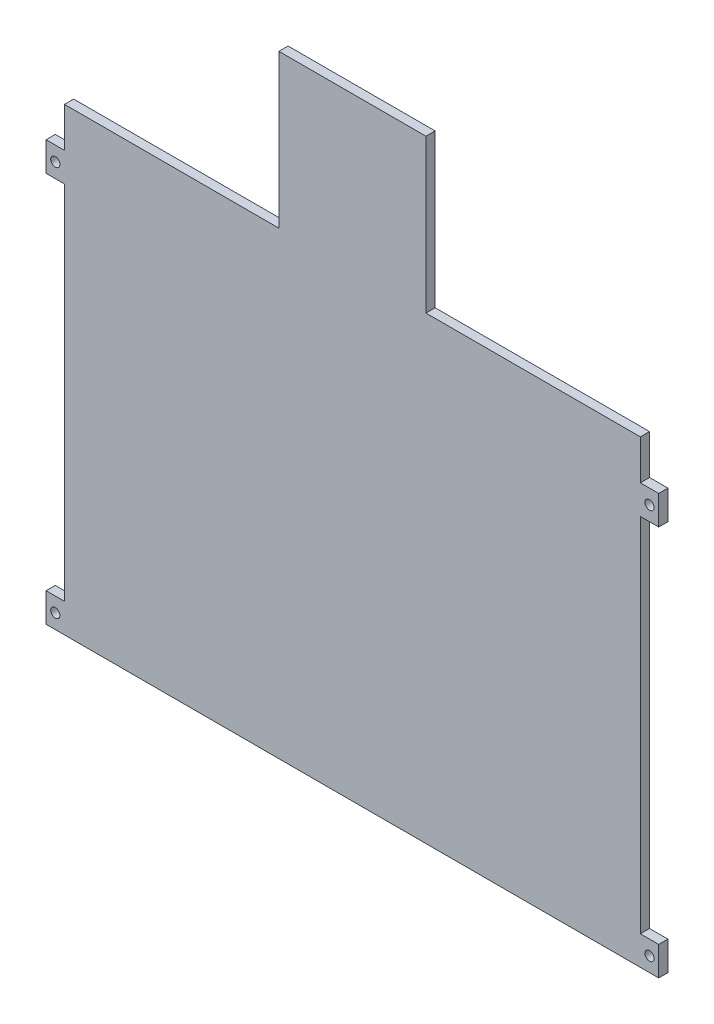
ISO-10303-21;
HEADER;
FILE_DESCRIPTION(('STEP AP214'),'2;1');
FILE_NAME('part.step','',(''),(''),'','','');
FILE_SCHEMA(('AUTOMOTIVE_DESIGN { 1 0 10303 214 1 1 1 1 }'));
ENDSEC;
DATA;
#1=APPLICATION_CONTEXT('core data for automotive mechanical design processes');
#2=APPLICATION_PROTOCOL_DEFINITION('international standard','automotive_design',2000,#1);
#3=PRODUCT_CONTEXT('',#1,'mechanical');
#4=PRODUCT('Part','Part','',(#3));
#5=PRODUCT_RELATED_PRODUCT_CATEGORY('part','',(#4));
#6=PRODUCT_DEFINITION_FORMATION('','',#4);
#7=PRODUCT_DEFINITION_CONTEXT('part definition',#1,'design');
#8=PRODUCT_DEFINITION('design','',#6,#7);
#9=PRODUCT_DEFINITION_SHAPE('','',#8);
#10=(LENGTH_UNIT() NAMED_UNIT(*) SI_UNIT(.MILLI.,.METRE.));
#11=(NAMED_UNIT(*) PLANE_ANGLE_UNIT() SI_UNIT($,.RADIAN.));
#12=(NAMED_UNIT(*) SI_UNIT($,.STERADIAN.) SOLID_ANGLE_UNIT());
#13=UNCERTAINTY_MEASURE_WITH_UNIT(LENGTH_MEASURE(1.E-05),#10,'distance_accuracy_value','');
#14=(GEOMETRIC_REPRESENTATION_CONTEXT(3) GLOBAL_UNCERTAINTY_ASSIGNED_CONTEXT((#13)) GLOBAL_UNIT_ASSIGNED_CONTEXT((#10,
#11,#12)) REPRESENTATION_CONTEXT('',''));
#15=CARTESIAN_POINT('',(0.,0.,0.));
#16=DIRECTION('',(0.,0.,1.));
#17=DIRECTION('',(1.,0.,0.));
#18=AXIS2_PLACEMENT_3D('',#15,#16,#17);
#19=CARTESIAN_POINT('',(0.,0.,3.));
#20=DIRECTION('',(0.,0.,1.));
#21=DIRECTION('',(1.,0.,0.));
#22=AXIS2_PLACEMENT_3D('',#19,#20,#21);
#23=PLANE('',#22);
#24=CARTESIAN_POINT('',(-97.,32.2499999999999,3.));
#25=DIRECTION('',(0.,0.,1.));
#26=DIRECTION('',(-1.,0.,0.));
#27=AXIS2_PLACEMENT_3D('',#24,#25,#26);
#28=CIRCLE('',#27,1.5);
#29=CARTESIAN_POINT('',(-98.5,32.2499999999999,3.));
#30=VERTEX_POINT('',#29);
#31=EDGE_CURVE('E607',#30,#30,#28,.T.);
#32=ORIENTED_EDGE('',*,*,#31,.F.);
#33=EDGE_LOOP('',(#32));
#34=FACE_BOUND('',#33,.T.);
#35=CARTESIAN_POINT('',(97.0000000000001,-95.25,3.));
#36=DIRECTION('',(0.,0.,1.));
#37=DIRECTION('',(1.,0.,0.));
#38=AXIS2_PLACEMENT_3D('',#35,#36,#37);
#39=CIRCLE('',#38,1.49999999999997);
#40=CARTESIAN_POINT('',(98.5,-95.25,3.));
#41=VERTEX_POINT('',#40);
#42=EDGE_CURVE('E211',#41,#41,#39,.T.);
#43=ORIENTED_EDGE('',*,*,#42,.F.);
#44=EDGE_LOOP('',(#43));
#45=FACE_BOUND('',#44,.T.);
#46=DIRECTION('',(1.,0.,0.));
#47=VECTOR('',#46,1.);
#48=CARTESIAN_POINT('',(94.,-100.,3.));
#49=LINE('',#48,#47);
#50=CARTESIAN_POINT('',(-100.,-100.,3.));
#51=VERTEX_POINT('',#50);
#52=CARTESIAN_POINT('',(100.,-100.,3.));
#53=VERTEX_POINT('',#52);
#54=EDGE_CURVE('E51',#51,#53,#49,.T.);
#55=ORIENTED_EDGE('',*,*,#54,.T.);
#56=DIRECTION('',(0.,1.,0.));
#57=VECTOR('',#56,1.);
#58=CARTESIAN_POINT('',(100.,-100.,3.));
#59=LINE('',#58,#57);
#60=CARTESIAN_POINT('',(100.,-90.5,3.));
#61=VERTEX_POINT('',#60);
#62=EDGE_CURVE('E132',#53,#61,#59,.T.);
#63=ORIENTED_EDGE('',*,*,#62,.T.);
#64=DIRECTION('',(-1.,0.,0.));
#65=VECTOR('',#64,1.);
#66=CARTESIAN_POINT('',(100.,-90.5,3.));
#67=LINE('',#66,#65);
#68=CARTESIAN_POINT('',(94.0000000000001,-90.5,3.));
#69=VERTEX_POINT('',#68);
#70=EDGE_CURVE('E296',#61,#69,#67,.T.);
#71=ORIENTED_EDGE('',*,*,#70,.T.);
#72=DIRECTION('',(0.,1.,0.));
#73=VECTOR('',#72,1.);
#74=CARTESIAN_POINT('',(94.,27.5,3.));
#75=LINE('',#74,#73);
#76=CARTESIAN_POINT('',(94.,27.5,3.));
#77=VERTEX_POINT('',#76);
#78=EDGE_CURVE('E313',#69,#77,#75,.T.);
#79=ORIENTED_EDGE('',*,*,#78,.T.);
#80=DIRECTION('',(1.,0.,0.));
#81=VECTOR('',#80,1.);
#82=CARTESIAN_POINT('',(94.,27.5,3.));
#83=LINE('',#82,#81);
#84=CARTESIAN_POINT('',(100.,27.5,3.));
#85=VERTEX_POINT('',#84);
#86=EDGE_CURVE('E310',#77,#85,#83,.T.);
#87=ORIENTED_EDGE('',*,*,#86,.T.);
#88=DIRECTION('',(0.,1.,0.));
#89=VECTOR('',#88,1.);
#90=CARTESIAN_POINT('',(100.,27.5,3.));
#91=LINE('',#90,#89);
#92=CARTESIAN_POINT('',(100.,37.,3.));
#93=VERTEX_POINT('',#92);
#94=EDGE_CURVE('E312',#85,#93,#91,.T.);
#95=ORIENTED_EDGE('',*,*,#94,.T.);
#96=DIRECTION('',(-1.,0.,0.));
#97=VECTOR('',#96,1.);
#98=CARTESIAN_POINT('',(100.,37.,3.));
#99=LINE('',#98,#97);
#100=CARTESIAN_POINT('',(94.,37.,3.));
#101=VERTEX_POINT('',#100);
#102=EDGE_CURVE('E315',#93,#101,#99,.T.);
#103=ORIENTED_EDGE('',*,*,#102,.T.);
#104=DIRECTION('',(0.,1.,0.));
#105=VECTOR('',#104,1.);
#106=CARTESIAN_POINT('',(94.,50.,3.));
#107=LINE('',#106,#105);
#108=CARTESIAN_POINT('',(94.,50.,3.));
#109=VERTEX_POINT('',#108);
#110=EDGE_CURVE('E321',#101,#109,#107,.T.);
#111=ORIENTED_EDGE('',*,*,#110,.T.);
#112=DIRECTION('',(-1.,0.,0.));
#113=VECTOR('',#112,1.);
#114=CARTESIAN_POINT('',(24.,50.,3.));
#115=LINE('',#114,#113);
#116=CARTESIAN_POINT('',(24.,50.,3.));
#117=VERTEX_POINT('',#116);
#118=EDGE_CURVE('E323',#109,#117,#115,.T.);
#119=ORIENTED_EDGE('',*,*,#118,.T.);
#120=DIRECTION('',(0.,1.,0.));
#121=VECTOR('',#120,1.);
#122=CARTESIAN_POINT('',(24.,100.,3.));
#123=LINE('',#122,#121);
#124=CARTESIAN_POINT('',(24.,100.,3.));
#125=VERTEX_POINT('',#124);
#126=EDGE_CURVE('E325',#117,#125,#123,.T.);
#127=ORIENTED_EDGE('',*,*,#126,.T.);
#128=DIRECTION('',(-1.,0.,0.));
#129=VECTOR('',#128,1.);
#130=CARTESIAN_POINT('',(-24.,100.,3.));
#131=LINE('',#130,#129);
#132=CARTESIAN_POINT('',(-24.,100.,3.));
#133=VERTEX_POINT('',#132);
#134=EDGE_CURVE('E327',#125,#133,#131,.T.);
#135=ORIENTED_EDGE('',*,*,#134,.T.);
#136=DIRECTION('',(0.,-1.,0.));
#137=VECTOR('',#136,1.);
#138=CARTESIAN_POINT('',(-24.,100.,3.));
#139=LINE('',#138,#137);
#140=CARTESIAN_POINT('',(-24.,50.,3.));
#141=VERTEX_POINT('',#140);
#142=EDGE_CURVE('E329',#133,#141,#139,.T.);
#143=ORIENTED_EDGE('',*,*,#142,.T.);
#144=DIRECTION('',(-1.,0.,0.));
#145=VECTOR('',#144,1.);
#146=CARTESIAN_POINT('',(-24.,50.,3.));
#147=LINE('',#146,#145);
#148=CARTESIAN_POINT('',(-94.,50.,3.));
#149=VERTEX_POINT('',#148);
#150=EDGE_CURVE('E331',#141,#149,#147,.T.);
#151=ORIENTED_EDGE('',*,*,#150,.T.);
#152=DIRECTION('',(0.,-1.,0.));
#153=VECTOR('',#152,1.);
#154=CARTESIAN_POINT('',(-94.,50.,3.));
#155=LINE('',#154,#153);
#156=CARTESIAN_POINT('',(-94.,37.,3.));
#157=VERTEX_POINT('',#156);
#158=EDGE_CURVE('E333',#149,#157,#155,.T.);
#159=ORIENTED_EDGE('',*,*,#158,.T.);
#160=DIRECTION('',(-1.,0.,0.));
#161=VECTOR('',#160,1.);
#162=CARTESIAN_POINT('',(-100.,36.9999999999999,3.));
#163=LINE('',#162,#161);
#164=CARTESIAN_POINT('',(-100.,36.9999999999999,3.));
#165=VERTEX_POINT('',#164);
#166=EDGE_CURVE('E335',#157,#165,#163,.T.);
#167=ORIENTED_EDGE('',*,*,#166,.T.);
#168=DIRECTION('',(0.,-1.,0.));
#169=VECTOR('',#168,1.);
#170=CARTESIAN_POINT('',(-100.,27.4999999999999,3.));
#171=LINE('',#170,#169);
#172=CARTESIAN_POINT('',(-100.,27.4999999999999,3.));
#173=VERTEX_POINT('',#172);
#174=EDGE_CURVE('E337',#165,#173,#171,.T.);
#175=ORIENTED_EDGE('',*,*,#174,.T.);
#176=DIRECTION('',(1.,0.,0.));
#177=VECTOR('',#176,1.);
#178=CARTESIAN_POINT('',(-94.,27.4999999999999,3.));
#179=LINE('',#178,#177);
#180=CARTESIAN_POINT('',(-94.,27.4999999999999,3.));
#181=VERTEX_POINT('',#180);
#182=EDGE_CURVE('E188',#173,#181,#179,.T.);
#183=ORIENTED_EDGE('',*,*,#182,.T.);
#184=DIRECTION('',(0.,-1.,0.));
#185=VECTOR('',#184,1.);
#186=CARTESIAN_POINT('',(-94.,27.4999999999999,3.));
#187=LINE('',#186,#185);
#188=CARTESIAN_POINT('',(-94.,-90.5,3.));
#189=VERTEX_POINT('',#188);
#190=EDGE_CURVE('E182',#181,#189,#187,.T.);
#191=ORIENTED_EDGE('',*,*,#190,.T.);
#192=DIRECTION('',(-1.,0.,0.));
#193=VECTOR('',#192,1.);
#194=CARTESIAN_POINT('',(-100.,-90.5000000000001,3.));
#195=LINE('',#194,#193);
#196=CARTESIAN_POINT('',(-100.,-90.5000000000001,3.));
#197=VERTEX_POINT('',#196);
#198=EDGE_CURVE('E186',#189,#197,#195,.T.);
#199=ORIENTED_EDGE('',*,*,#198,.T.);
#200=DIRECTION('',(0.,-1.,0.));
#201=VECTOR('',#200,1.);
#202=CARTESIAN_POINT('',(-100.,-100.,3.));
#203=LINE('',#202,#201);
#204=EDGE_CURVE('E202',#197,#51,#203,.T.);
#205=ORIENTED_EDGE('',*,*,#204,.T.);
#206=EDGE_LOOP('',(#55,#63,#71,#79,#87,#95,#103,#111,#119,#127,#135,#143,#151,#159,#167,#175,
#183,#191,#199,#205));
#207=FACE_BOUND('',#206,.T.);
#208=CARTESIAN_POINT('',(97.,32.25,3.));
#209=DIRECTION('',(0.,0.,1.));
#210=DIRECTION('',(1.,0.,0.));
#211=AXIS2_PLACEMENT_3D('',#208,#209,#210);
#212=CIRCLE('',#211,1.5);
#213=CARTESIAN_POINT('',(98.5,32.25,3.));
#214=VERTEX_POINT('',#213);
#215=EDGE_CURVE('E613',#214,#214,#212,.T.);
#216=ORIENTED_EDGE('',*,*,#215,.F.);
#217=EDGE_LOOP('',(#216));
#218=FACE_BOUND('',#217,.T.);
#219=CARTESIAN_POINT('',(-97.,-95.25,3.));
#220=DIRECTION('',(0.,0.,1.));
#221=DIRECTION('',(-1.,0.,0.));
#222=AXIS2_PLACEMENT_3D('',#219,#220,#221);
#223=CIRCLE('',#222,1.5);
#224=CARTESIAN_POINT('',(-98.5,-95.25,3.));
#225=VERTEX_POINT('',#224);
#226=EDGE_CURVE('E598',#225,#225,#223,.T.);
#227=ORIENTED_EDGE('',*,*,#226,.F.);
#228=EDGE_LOOP('',(#227));
#229=FACE_BOUND('',#228,.T.);
#230=ADVANCED_FACE('F34',(#34,#45,#207,#218,#229),#23,.T.);
#231=CARTESIAN_POINT('',(0.,0.,0.));
#232=DIRECTION('',(0.,0.,1.));
#233=DIRECTION('',(1.,0.,0.));
#234=AXIS2_PLACEMENT_3D('',#231,#232,#233);
#235=PLANE('',#234);
#236=DIRECTION('',(0.,1.,0.));
#237=VECTOR('',#236,1.);
#238=CARTESIAN_POINT('',(100.,-100.,0.));
#239=LINE('',#238,#237);
#240=CARTESIAN_POINT('',(100.,-100.,0.));
#241=VERTEX_POINT('',#240);
#242=CARTESIAN_POINT('',(100.,-90.5,0.));
#243=VERTEX_POINT('',#242);
#244=EDGE_CURVE('E208',#241,#243,#239,.T.);
#245=ORIENTED_EDGE('',*,*,#244,.F.);
#246=DIRECTION('',(1.,0.,0.));
#247=VECTOR('',#246,1.);
#248=CARTESIAN_POINT('',(-94.,-100.,0.));
#249=LINE('',#248,#247);
#250=CARTESIAN_POINT('',(-100.,-100.,0.));
#251=VERTEX_POINT('',#250);
#252=EDGE_CURVE('E124',#251,#241,#249,.T.);
#253=ORIENTED_EDGE('',*,*,#252,.F.);
#254=DIRECTION('',(0.,-1.,0.));
#255=VECTOR('',#254,1.);
#256=CARTESIAN_POINT('',(-100.,-100.,0.));
#257=LINE('',#256,#255);
#258=CARTESIAN_POINT('',(-100.,-90.5000000000001,0.));
#259=VERTEX_POINT('',#258);
#260=EDGE_CURVE('E243',#259,#251,#257,.T.);
#261=ORIENTED_EDGE('',*,*,#260,.F.);
#262=DIRECTION('',(-1.,0.,0.));
#263=VECTOR('',#262,1.);
#264=CARTESIAN_POINT('',(-100.,-90.5000000000001,0.));
#265=LINE('',#264,#263);
#266=CARTESIAN_POINT('',(-94.,-90.5,0.));
#267=VERTEX_POINT('',#266);
#268=EDGE_CURVE('E117',#267,#259,#265,.T.);
#269=ORIENTED_EDGE('',*,*,#268,.F.);
#270=DIRECTION('',(0.,-1.,0.));
#271=VECTOR('',#270,1.);
#272=CARTESIAN_POINT('',(-94.,27.4999999999999,0.));
#273=LINE('',#272,#271);
#274=CARTESIAN_POINT('',(-94.,27.4999999999999,0.));
#275=VERTEX_POINT('',#274);
#276=EDGE_CURVE('E196',#275,#267,#273,.T.);
#277=ORIENTED_EDGE('',*,*,#276,.F.);
#278=DIRECTION('',(1.,0.,0.));
#279=VECTOR('',#278,1.);
#280=CARTESIAN_POINT('',(-94.,27.4999999999999,0.));
#281=LINE('',#280,#279);
#282=CARTESIAN_POINT('',(-100.,27.4999999999999,0.));
#283=VERTEX_POINT('',#282);
#284=EDGE_CURVE('E239',#283,#275,#281,.T.);
#285=ORIENTED_EDGE('',*,*,#284,.F.);
#286=DIRECTION('',(0.,-1.,0.));
#287=VECTOR('',#286,1.);
#288=CARTESIAN_POINT('',(-100.,27.4999999999999,0.));
#289=LINE('',#288,#287);
#290=CARTESIAN_POINT('',(-100.,36.9999999999999,0.));
#291=VERTEX_POINT('',#290);
#292=EDGE_CURVE('E237',#291,#283,#289,.T.);
#293=ORIENTED_EDGE('',*,*,#292,.F.);
#294=DIRECTION('',(-1.,0.,0.));
#295=VECTOR('',#294,1.);
#296=CARTESIAN_POINT('',(-100.,36.9999999999999,0.));
#297=LINE('',#296,#295);
#298=CARTESIAN_POINT('',(-94.,37.,0.));
#299=VERTEX_POINT('',#298);
#300=EDGE_CURVE('E235',#299,#291,#297,.T.);
#301=ORIENTED_EDGE('',*,*,#300,.F.);
#302=DIRECTION('',(0.,-1.,0.));
#303=VECTOR('',#302,1.);
#304=CARTESIAN_POINT('',(-94.,50.,0.));
#305=LINE('',#304,#303);
#306=CARTESIAN_POINT('',(-94.,50.,0.));
#307=VERTEX_POINT('',#306);
#308=EDGE_CURVE('E233',#307,#299,#305,.T.);
#309=ORIENTED_EDGE('',*,*,#308,.F.);
#310=DIRECTION('',(-1.,0.,0.));
#311=VECTOR('',#310,1.);
#312=CARTESIAN_POINT('',(-24.,50.,0.));
#313=LINE('',#312,#311);
#314=CARTESIAN_POINT('',(-24.,50.,0.));
#315=VERTEX_POINT('',#314);
#316=EDGE_CURVE('E231',#315,#307,#313,.T.);
#317=ORIENTED_EDGE('',*,*,#316,.F.);
#318=DIRECTION('',(0.,-1.,0.));
#319=VECTOR('',#318,1.);
#320=CARTESIAN_POINT('',(-24.,100.,0.));
#321=LINE('',#320,#319);
#322=CARTESIAN_POINT('',(-24.,100.,0.));
#323=VERTEX_POINT('',#322);
#324=EDGE_CURVE('E229',#323,#315,#321,.T.);
#325=ORIENTED_EDGE('',*,*,#324,.F.);
#326=DIRECTION('',(-1.,0.,0.));
#327=VECTOR('',#326,1.);
#328=CARTESIAN_POINT('',(-24.,100.,0.));
#329=LINE('',#328,#327);
#330=CARTESIAN_POINT('',(24.,100.,0.));
#331=VERTEX_POINT('',#330);
#332=EDGE_CURVE('E227',#331,#323,#329,.T.);
#333=ORIENTED_EDGE('',*,*,#332,.F.);
#334=DIRECTION('',(0.,1.,0.));
#335=VECTOR('',#334,1.);
#336=CARTESIAN_POINT('',(24.,100.,0.));
#337=LINE('',#336,#335);
#338=CARTESIAN_POINT('',(24.,50.,0.));
#339=VERTEX_POINT('',#338);
#340=EDGE_CURVE('E225',#339,#331,#337,.T.);
#341=ORIENTED_EDGE('',*,*,#340,.F.);
#342=DIRECTION('',(-1.,0.,0.));
#343=VECTOR('',#342,1.);
#344=CARTESIAN_POINT('',(24.,50.,0.));
#345=LINE('',#344,#343);
#346=CARTESIAN_POINT('',(94.,50.,0.));
#347=VERTEX_POINT('',#346);
#348=EDGE_CURVE('E223',#347,#339,#345,.T.);
#349=ORIENTED_EDGE('',*,*,#348,.F.);
#350=DIRECTION('',(0.,1.,0.));
#351=VECTOR('',#350,1.);
#352=CARTESIAN_POINT('',(94.,50.,0.));
#353=LINE('',#352,#351);
#354=CARTESIAN_POINT('',(94.,37.,0.));
#355=VERTEX_POINT('',#354);
#356=EDGE_CURVE('E221',#355,#347,#353,.T.);
#357=ORIENTED_EDGE('',*,*,#356,.F.);
#358=DIRECTION('',(-1.,0.,0.));
#359=VECTOR('',#358,1.);
#360=CARTESIAN_POINT('',(100.,37.,0.));
#361=LINE('',#360,#359);
#362=CARTESIAN_POINT('',(100.,37.,0.));
#363=VERTEX_POINT('',#362);
#364=EDGE_CURVE('E219',#363,#355,#361,.T.);
#365=ORIENTED_EDGE('',*,*,#364,.F.);
#366=DIRECTION('',(0.,1.,0.));
#367=VECTOR('',#366,1.);
#368=CARTESIAN_POINT('',(100.,27.5,0.));
#369=LINE('',#368,#367);
#370=CARTESIAN_POINT('',(100.,27.5,0.));
#371=VERTEX_POINT('',#370);
#372=EDGE_CURVE('E217',#371,#363,#369,.T.);
#373=ORIENTED_EDGE('',*,*,#372,.F.);
#374=DIRECTION('',(1.,0.,0.));
#375=VECTOR('',#374,1.);
#376=CARTESIAN_POINT('',(94.,27.5,0.));
#377=LINE('',#376,#375);
#378=CARTESIAN_POINT('',(94.,27.5,0.));
#379=VERTEX_POINT('',#378);
#380=EDGE_CURVE('E215',#379,#371,#377,.T.);
#381=ORIENTED_EDGE('',*,*,#380,.F.);
#382=DIRECTION('',(0.,1.,0.));
#383=VECTOR('',#382,1.);
#384=CARTESIAN_POINT('',(94.,27.5,0.));
#385=LINE('',#384,#383);
#386=CARTESIAN_POINT('',(94.0000000000001,-90.5,0.));
#387=VERTEX_POINT('',#386);
#388=EDGE_CURVE('E213',#387,#379,#385,.T.);
#389=ORIENTED_EDGE('',*,*,#388,.F.);
#390=DIRECTION('',(-1.,0.,0.));
#391=VECTOR('',#390,1.);
#392=CARTESIAN_POINT('',(100.,-90.5,0.));
#393=LINE('',#392,#391);
#394=EDGE_CURVE('E210',#243,#387,#393,.T.);
#395=ORIENTED_EDGE('',*,*,#394,.F.);
#396=EDGE_LOOP('',(#245,#253,#261,#269,#277,#285,#293,#301,#309,#317,#325,#333,#341,#349,#357,
#365,#373,#381,#389,#395));
#397=FACE_BOUND('',#396,.T.);
#398=CARTESIAN_POINT('',(97.0000000000001,-95.25,0.));
#399=DIRECTION('',(0.,0.,1.));
#400=DIRECTION('',(1.,0.,0.));
#401=AXIS2_PLACEMENT_3D('',#398,#399,#400);
#402=CIRCLE('',#401,1.49999999999997);
#403=CARTESIAN_POINT('',(98.5,-95.25,0.));
#404=VERTEX_POINT('',#403);
#405=EDGE_CURVE('E616',#404,#404,#402,.T.);
#406=ORIENTED_EDGE('',*,*,#405,.T.);
#407=EDGE_LOOP('',(#406));
#408=FACE_BOUND('',#407,.T.);
#409=CARTESIAN_POINT('',(97.,32.25,0.));
#410=DIRECTION('',(0.,0.,1.));
#411=DIRECTION('',(1.,0.,0.));
#412=AXIS2_PLACEMENT_3D('',#409,#410,#411);
#413=CIRCLE('',#412,1.5);
#414=CARTESIAN_POINT('',(98.5,32.25,0.));
#415=VERTEX_POINT('',#414);
#416=EDGE_CURVE('E610',#415,#415,#413,.T.);
#417=ORIENTED_EDGE('',*,*,#416,.T.);
#418=EDGE_LOOP('',(#417));
#419=FACE_BOUND('',#418,.T.);
#420=CARTESIAN_POINT('',(-97.,32.2499999999999,0.));
#421=DIRECTION('',(0.,0.,1.));
#422=DIRECTION('',(-1.,0.,0.));
#423=AXIS2_PLACEMENT_3D('',#420,#421,#422);
#424=CIRCLE('',#423,1.5);
#425=CARTESIAN_POINT('',(-98.5,32.2499999999999,0.));
#426=VERTEX_POINT('',#425);
#427=EDGE_CURVE('E604',#426,#426,#424,.T.);
#428=ORIENTED_EDGE('',*,*,#427,.T.);
#429=EDGE_LOOP('',(#428));
#430=FACE_BOUND('',#429,.T.);
#431=CARTESIAN_POINT('',(-97.,-95.25,0.));
#432=DIRECTION('',(0.,0.,1.));
#433=DIRECTION('',(-1.,0.,0.));
#434=AXIS2_PLACEMENT_3D('',#431,#432,#433);
#435=CIRCLE('',#434,1.5);
#436=CARTESIAN_POINT('',(-98.5,-95.25,0.));
#437=VERTEX_POINT('',#436);
#438=EDGE_CURVE('E601',#437,#437,#435,.T.);
#439=ORIENTED_EDGE('',*,*,#438,.T.);
#440=EDGE_LOOP('',(#439));
#441=FACE_BOUND('',#440,.T.);
#442=ADVANCED_FACE('F298',(#397,#408,#419,#430,#441),#235,.F.);
#443=CARTESIAN_POINT('',(100.,-100.,3.));
#444=DIRECTION('',(-1.,0.,0.));
#445=DIRECTION('',(0.,0.,1.));
#446=AXIS2_PLACEMENT_3D('',#443,#444,#445);
#447=PLANE('',#446);
#448=ORIENTED_EDGE('',*,*,#244,.T.);
#449=DIRECTION('',(0.,0.,-1.));
#450=VECTOR('',#449,1.);
#451=CARTESIAN_POINT('',(100.,-90.5,3.));
#452=LINE('',#451,#450);
#453=EDGE_CURVE('E43',#61,#243,#452,.T.);
#454=ORIENTED_EDGE('',*,*,#453,.F.);
#455=ORIENTED_EDGE('',*,*,#62,.F.);
#456=DIRECTION('',(0.,0.,-1.));
#457=VECTOR('',#456,1.);
#458=CARTESIAN_POINT('',(100.,-100.,3.));
#459=LINE('',#458,#457);
#460=EDGE_CURVE('E11',#53,#241,#459,.T.);
#461=ORIENTED_EDGE('',*,*,#460,.T.);
#462=EDGE_LOOP('',(#448,#454,#455,#461));
#463=FACE_BOUND('',#462,.T.);
#464=ADVANCED_FACE('F36',(#463),#447,.F.);
#465=CARTESIAN_POINT('',(100.,-90.5,3.));
#466=DIRECTION('',(0.,-1.,0.));
#467=DIRECTION('',(1.,0.,0.));
#468=AXIS2_PLACEMENT_3D('',#465,#466,#467);
#469=PLANE('',#468);
#470=ORIENTED_EDGE('',*,*,#394,.T.);
#471=DIRECTION('',(0.,0.,-1.));
#472=VECTOR('',#471,1.);
#473=CARTESIAN_POINT('',(94.0000000000001,-90.5,3.));
#474=LINE('',#473,#472);
#475=EDGE_CURVE('E288',#69,#387,#474,.T.);
#476=ORIENTED_EDGE('',*,*,#475,.F.);
#477=ORIENTED_EDGE('',*,*,#70,.F.);
#478=ORIENTED_EDGE('',*,*,#453,.T.);
#479=EDGE_LOOP('',(#470,#476,#477,#478));
#480=FACE_BOUND('',#479,.T.);
#481=ADVANCED_FACE('F294',(#480),#469,.F.);
#482=CARTESIAN_POINT('',(94.,27.5,3.));
#483=DIRECTION('',(-1.,0.,0.));
#484=DIRECTION('',(0.,-1.,0.));
#485=AXIS2_PLACEMENT_3D('',#482,#483,#484);
#486=PLANE('',#485);
#487=ORIENTED_EDGE('',*,*,#388,.T.);
#488=DIRECTION('',(0.,0.,-1.));
#489=VECTOR('',#488,1.);
#490=CARTESIAN_POINT('',(94.,27.5,3.));
#491=LINE('',#490,#489);
#492=EDGE_CURVE('E285',#77,#379,#491,.T.);
#493=ORIENTED_EDGE('',*,*,#492,.F.);
#494=ORIENTED_EDGE('',*,*,#78,.F.);
#495=ORIENTED_EDGE('',*,*,#475,.T.);
#496=EDGE_LOOP('',(#487,#493,#494,#495));
#497=FACE_BOUND('',#496,.T.);
#498=ADVANCED_FACE('F304',(#497),#486,.F.);
#499=CARTESIAN_POINT('',(94.,27.5,3.));
#500=DIRECTION('',(0.,1.,0.));
#501=DIRECTION('',(0.,0.,1.));
#502=AXIS2_PLACEMENT_3D('',#499,#500,#501);
#503=PLANE('',#502);
#504=ORIENTED_EDGE('',*,*,#380,.T.);
#505=DIRECTION('',(0.,0.,-1.));
#506=VECTOR('',#505,1.);
#507=CARTESIAN_POINT('',(100.,27.5,3.));
#508=LINE('',#507,#506);
#509=EDGE_CURVE('E282',#85,#371,#508,.T.);
#510=ORIENTED_EDGE('',*,*,#509,.F.);
#511=ORIENTED_EDGE('',*,*,#86,.F.);
#512=ORIENTED_EDGE('',*,*,#492,.T.);
#513=EDGE_LOOP('',(#504,#510,#511,#512));
#514=FACE_BOUND('',#513,.T.);
#515=ADVANCED_FACE('F308',(#514),#503,.F.);
#516=CARTESIAN_POINT('',(100.,27.5,3.));
#517=DIRECTION('',(-1.,0.,0.));
#518=DIRECTION('',(0.,0.,1.));
#519=AXIS2_PLACEMENT_3D('',#516,#517,#518);
#520=PLANE('',#519);
#521=ORIENTED_EDGE('',*,*,#372,.T.);
#522=DIRECTION('',(0.,0.,-1.));
#523=VECTOR('',#522,1.);
#524=CARTESIAN_POINT('',(100.,37.,3.));
#525=LINE('',#524,#523);
#526=EDGE_CURVE('E279',#93,#363,#525,.T.);
#527=ORIENTED_EDGE('',*,*,#526,.F.);
#528=ORIENTED_EDGE('',*,*,#94,.F.);
#529=ORIENTED_EDGE('',*,*,#509,.T.);
#530=EDGE_LOOP('',(#521,#527,#528,#529));
#531=FACE_BOUND('',#530,.T.);
#532=ADVANCED_FACE('F416',(#531),#520,.F.);
#533=CARTESIAN_POINT('',(100.,37.,3.));
#534=DIRECTION('',(0.,-1.,0.));
#535=DIRECTION('',(0.,0.,-1.));
#536=AXIS2_PLACEMENT_3D('',#533,#534,#535);
#537=PLANE('',#536);
#538=ORIENTED_EDGE('',*,*,#364,.T.);
#539=DIRECTION('',(0.,0.,-1.));
#540=VECTOR('',#539,1.);
#541=CARTESIAN_POINT('',(94.,37.,3.));
#542=LINE('',#541,#540);
#543=EDGE_CURVE('E276',#101,#355,#542,.T.);
#544=ORIENTED_EDGE('',*,*,#543,.F.);
#545=ORIENTED_EDGE('',*,*,#102,.F.);
#546=ORIENTED_EDGE('',*,*,#526,.T.);
#547=EDGE_LOOP('',(#538,#544,#545,#546));
#548=FACE_BOUND('',#547,.T.);
#549=ADVANCED_FACE('F412',(#548),#537,.F.);
#550=CARTESIAN_POINT('',(94.,50.,3.));
#551=DIRECTION('',(-1.,0.,0.));
#552=DIRECTION('',(0.,-1.,0.));
#553=AXIS2_PLACEMENT_3D('',#550,#551,#552);
#554=PLANE('',#553);
#555=ORIENTED_EDGE('',*,*,#356,.T.);
#556=DIRECTION('',(0.,0.,-1.));
#557=VECTOR('',#556,1.);
#558=CARTESIAN_POINT('',(94.,50.,3.));
#559=LINE('',#558,#557);
#560=EDGE_CURVE('E273',#109,#347,#559,.T.);
#561=ORIENTED_EDGE('',*,*,#560,.F.);
#562=ORIENTED_EDGE('',*,*,#110,.F.);
#563=ORIENTED_EDGE('',*,*,#543,.T.);
#564=EDGE_LOOP('',(#555,#561,#562,#563));
#565=FACE_BOUND('',#564,.T.);
#566=ADVANCED_FACE('F408',(#565),#554,.F.);
#567=CARTESIAN_POINT('',(24.,50.,3.));
#568=DIRECTION('',(0.,-1.,0.));
#569=DIRECTION('',(1.,0.,0.));
#570=AXIS2_PLACEMENT_3D('',#567,#568,#569);
#571=PLANE('',#570);
#572=ORIENTED_EDGE('',*,*,#348,.T.);
#573=DIRECTION('',(0.,0.,-1.));
#574=VECTOR('',#573,1.);
#575=CARTESIAN_POINT('',(24.,50.,3.));
#576=LINE('',#575,#574);
#577=EDGE_CURVE('E270',#117,#339,#576,.T.);
#578=ORIENTED_EDGE('',*,*,#577,.F.);
#579=ORIENTED_EDGE('',*,*,#118,.F.);
#580=ORIENTED_EDGE('',*,*,#560,.T.);
#581=EDGE_LOOP('',(#572,#578,#579,#580));
#582=FACE_BOUND('',#581,.T.);
#583=ADVANCED_FACE('F404',(#582),#571,.F.);
#584=CARTESIAN_POINT('',(24.,100.,3.));
#585=DIRECTION('',(-1.,0.,0.));
#586=DIRECTION('',(0.,-1.,0.));
#587=AXIS2_PLACEMENT_3D('',#584,#585,#586);
#588=PLANE('',#587);
#589=ORIENTED_EDGE('',*,*,#340,.T.);
#590=DIRECTION('',(0.,0.,-1.));
#591=VECTOR('',#590,1.);
#592=CARTESIAN_POINT('',(24.,100.,3.));
#593=LINE('',#592,#591);
#594=EDGE_CURVE('E267',#125,#331,#593,.T.);
#595=ORIENTED_EDGE('',*,*,#594,.F.);
#596=ORIENTED_EDGE('',*,*,#126,.F.);
#597=ORIENTED_EDGE('',*,*,#577,.T.);
#598=EDGE_LOOP('',(#589,#595,#596,#597));
#599=FACE_BOUND('',#598,.T.);
#600=ADVANCED_FACE('F400',(#599),#588,.F.);
#601=CARTESIAN_POINT('',(-24.,100.,3.));
#602=DIRECTION('',(0.,-1.,0.));
#603=DIRECTION('',(0.,0.,-1.));
#604=AXIS2_PLACEMENT_3D('',#601,#602,#603);
#605=PLANE('',#604);
#606=ORIENTED_EDGE('',*,*,#332,.T.);
#607=DIRECTION('',(0.,0.,-1.));
#608=VECTOR('',#607,1.);
#609=CARTESIAN_POINT('',(-24.,100.,3.));
#610=LINE('',#609,#608);
#611=EDGE_CURVE('E264',#133,#323,#610,.T.);
#612=ORIENTED_EDGE('',*,*,#611,.F.);
#613=ORIENTED_EDGE('',*,*,#134,.F.);
#614=ORIENTED_EDGE('',*,*,#594,.T.);
#615=EDGE_LOOP('',(#606,#612,#613,#614));
#616=FACE_BOUND('',#615,.T.);
#617=ADVANCED_FACE('F396',(#616),#605,.F.);
#618=CARTESIAN_POINT('',(-24.,100.,3.));
#619=DIRECTION('',(1.,0.,0.));
#620=DIRECTION('',(0.,1.,0.));
#621=AXIS2_PLACEMENT_3D('',#618,#619,#620);
#622=PLANE('',#621);
#623=ORIENTED_EDGE('',*,*,#324,.T.);
#624=DIRECTION('',(0.,0.,-1.));
#625=VECTOR('',#624,1.);
#626=CARTESIAN_POINT('',(-24.,50.,3.));
#627=LINE('',#626,#625);
#628=EDGE_CURVE('E261',#141,#315,#627,.T.);
#629=ORIENTED_EDGE('',*,*,#628,.F.);
#630=ORIENTED_EDGE('',*,*,#142,.F.);
#631=ORIENTED_EDGE('',*,*,#611,.T.);
#632=EDGE_LOOP('',(#623,#629,#630,#631));
#633=FACE_BOUND('',#632,.T.);
#634=ADVANCED_FACE('F392',(#633),#622,.F.);
#635=CARTESIAN_POINT('',(-24.,50.,3.));
#636=DIRECTION('',(0.,-1.,0.));
#637=DIRECTION('',(0.,0.,-1.));
#638=AXIS2_PLACEMENT_3D('',#635,#636,#637);
#639=PLANE('',#638);
#640=ORIENTED_EDGE('',*,*,#316,.T.);
#641=DIRECTION('',(0.,0.,-1.));
#642=VECTOR('',#641,1.);
#643=CARTESIAN_POINT('',(-94.,50.,3.));
#644=LINE('',#643,#642);
#645=EDGE_CURVE('E258',#149,#307,#644,.T.);
#646=ORIENTED_EDGE('',*,*,#645,.F.);
#647=ORIENTED_EDGE('',*,*,#150,.F.);
#648=ORIENTED_EDGE('',*,*,#628,.T.);
#649=EDGE_LOOP('',(#640,#646,#647,#648));
#650=FACE_BOUND('',#649,.T.);
#651=ADVANCED_FACE('F388',(#650),#639,.F.);
#652=CARTESIAN_POINT('',(-94.,50.,3.));
#653=DIRECTION('',(1.,0.,0.));
#654=DIRECTION('',(0.,1.,0.));
#655=AXIS2_PLACEMENT_3D('',#652,#653,#654);
#656=PLANE('',#655);
#657=ORIENTED_EDGE('',*,*,#308,.T.);
#658=DIRECTION('',(0.,0.,-1.));
#659=VECTOR('',#658,1.);
#660=CARTESIAN_POINT('',(-94.,37.,3.));
#661=LINE('',#660,#659);
#662=EDGE_CURVE('E255',#157,#299,#661,.T.);
#663=ORIENTED_EDGE('',*,*,#662,.F.);
#664=ORIENTED_EDGE('',*,*,#158,.F.);
#665=ORIENTED_EDGE('',*,*,#645,.T.);
#666=EDGE_LOOP('',(#657,#663,#664,#665));
#667=FACE_BOUND('',#666,.T.);
#668=ADVANCED_FACE('F384',(#667),#656,.F.);
#669=CARTESIAN_POINT('',(-100.,36.9999999999999,3.));
#670=DIRECTION('',(0.,-1.,0.));
#671=DIRECTION('',(1.,0.,0.));
#672=AXIS2_PLACEMENT_3D('',#669,#670,#671);
#673=PLANE('',#672);
#674=ORIENTED_EDGE('',*,*,#300,.T.);
#675=DIRECTION('',(0.,0.,-1.));
#676=VECTOR('',#675,1.);
#677=CARTESIAN_POINT('',(-100.,36.9999999999999,3.));
#678=LINE('',#677,#676);
#679=EDGE_CURVE('E252',#165,#291,#678,.T.);
#680=ORIENTED_EDGE('',*,*,#679,.F.);
#681=ORIENTED_EDGE('',*,*,#166,.F.);
#682=ORIENTED_EDGE('',*,*,#662,.T.);
#683=EDGE_LOOP('',(#674,#680,#681,#682));
#684=FACE_BOUND('',#683,.T.);
#685=ADVANCED_FACE('F381',(#684),#673,.F.);
#686=CARTESIAN_POINT('',(-100.,27.4999999999999,3.));
#687=DIRECTION('',(1.,0.,0.));
#688=DIRECTION('',(0.,0.,-1.));
#689=AXIS2_PLACEMENT_3D('',#686,#687,#688);
#690=PLANE('',#689);
#691=ORIENTED_EDGE('',*,*,#292,.T.);
#692=DIRECTION('',(0.,0.,-1.));
#693=VECTOR('',#692,1.);
#694=CARTESIAN_POINT('',(-100.,27.4999999999999,3.));
#695=LINE('',#694,#693);
#696=EDGE_CURVE('E249',#173,#283,#695,.T.);
#697=ORIENTED_EDGE('',*,*,#696,.F.);
#698=ORIENTED_EDGE('',*,*,#174,.F.);
#699=ORIENTED_EDGE('',*,*,#679,.T.);
#700=EDGE_LOOP('',(#691,#697,#698,#699));
#701=FACE_BOUND('',#700,.T.);
#702=ADVANCED_FACE('F343',(#701),#690,.F.);
#703=CARTESIAN_POINT('',(-94.,27.4999999999999,3.));
#704=DIRECTION('',(0.,1.,0.));
#705=DIRECTION('',(0.,0.,1.));
#706=AXIS2_PLACEMENT_3D('',#703,#704,#705);
#707=PLANE('',#706);
#708=ORIENTED_EDGE('',*,*,#284,.T.);
#709=DIRECTION('',(0.,0.,-1.));
#710=VECTOR('',#709,1.);
#711=CARTESIAN_POINT('',(-94.,27.4999999999999,3.));
#712=LINE('',#711,#710);
#713=EDGE_CURVE('E197',#181,#275,#712,.T.);
#714=ORIENTED_EDGE('',*,*,#713,.F.);
#715=ORIENTED_EDGE('',*,*,#182,.F.);
#716=ORIENTED_EDGE('',*,*,#696,.T.);
#717=EDGE_LOOP('',(#708,#714,#715,#716));
#718=FACE_BOUND('',#717,.T.);
#719=ADVANCED_FACE('F347',(#718),#707,.F.);
#720=CARTESIAN_POINT('',(-94.,27.4999999999999,3.));
#721=DIRECTION('',(1.,0.,0.));
#722=DIRECTION('',(0.,1.,0.));
#723=AXIS2_PLACEMENT_3D('',#720,#721,#722);
#724=PLANE('',#723);
#725=ORIENTED_EDGE('',*,*,#276,.T.);
#726=DIRECTION('',(0.,0.,-1.));
#727=VECTOR('',#726,1.);
#728=CARTESIAN_POINT('',(-94.,-90.5,3.));
#729=LINE('',#728,#727);
#730=EDGE_CURVE('E193',#189,#267,#729,.T.);
#731=ORIENTED_EDGE('',*,*,#730,.F.);
#732=ORIENTED_EDGE('',*,*,#190,.F.);
#733=ORIENTED_EDGE('',*,*,#713,.T.);
#734=EDGE_LOOP('',(#725,#731,#732,#733));
#735=FACE_BOUND('',#734,.T.);
#736=ADVANCED_FACE('F194',(#735),#724,.F.);
#737=CARTESIAN_POINT('',(-100.,-90.5000000000001,3.));
#738=DIRECTION('',(0.,-1.,0.));
#739=DIRECTION('',(1.,0.,0.));
#740=AXIS2_PLACEMENT_3D('',#737,#738,#739);
#741=PLANE('',#740);
#742=ORIENTED_EDGE('',*,*,#268,.T.);
#743=DIRECTION('',(0.,0.,-1.));
#744=VECTOR('',#743,1.);
#745=CARTESIAN_POINT('',(-100.,-90.5000000000001,3.));
#746=LINE('',#745,#744);
#747=EDGE_CURVE('E198',#197,#259,#746,.T.);
#748=ORIENTED_EDGE('',*,*,#747,.F.);
#749=ORIENTED_EDGE('',*,*,#198,.F.);
#750=ORIENTED_EDGE('',*,*,#730,.T.);
#751=EDGE_LOOP('',(#742,#748,#749,#750));
#752=FACE_BOUND('',#751,.T.);
#753=ADVANCED_FACE('F200',(#752),#741,.F.);
#754=CARTESIAN_POINT('',(-100.,-100.,3.));
#755=DIRECTION('',(1.,0.,0.));
#756=DIRECTION('',(0.,0.,-1.));
#757=AXIS2_PLACEMENT_3D('',#754,#755,#756);
#758=PLANE('',#757);
#759=ORIENTED_EDGE('',*,*,#260,.T.);
#760=DIRECTION('',(0.,0.,-1.));
#761=VECTOR('',#760,1.);
#762=CARTESIAN_POINT('',(-100.,-100.,3.));
#763=LINE('',#762,#761);
#764=EDGE_CURVE('E204',#51,#251,#763,.T.);
#765=ORIENTED_EDGE('',*,*,#764,.F.);
#766=ORIENTED_EDGE('',*,*,#204,.F.);
#767=ORIENTED_EDGE('',*,*,#747,.T.);
#768=EDGE_LOOP('',(#759,#765,#766,#767));
#769=FACE_BOUND('',#768,.T.);
#770=ADVANCED_FACE('F350',(#769),#758,.F.);
#771=CARTESIAN_POINT('',(-94.,-100.,3.));
#772=DIRECTION('',(0.,1.,0.));
#773=DIRECTION('',(-1.,0.,0.));
#774=AXIS2_PLACEMENT_3D('',#771,#772,#773);
#775=PLANE('',#774);
#776=ORIENTED_EDGE('',*,*,#252,.T.);
#777=ORIENTED_EDGE('',*,*,#460,.F.);
#778=ORIENTED_EDGE('',*,*,#54,.F.);
#779=ORIENTED_EDGE('',*,*,#764,.T.);
#780=EDGE_LOOP('',(#776,#777,#778,#779));
#781=FACE_BOUND('',#780,.T.);
#782=ADVANCED_FACE('F351',(#781),#775,.F.);
#783=CARTESIAN_POINT('',(97.0000000000001,-95.25,3.));
#784=DIRECTION('',(0.,0.,-1.));
#785=DIRECTION('',(-1.,0.,0.));
#786=AXIS2_PLACEMENT_3D('',#783,#784,#785);
#787=CYLINDRICAL_SURFACE('',#786,1.49999999999997);
#788=ORIENTED_EDGE('',*,*,#42,.T.);
#789=EDGE_LOOP('',(#788));
#790=FACE_BOUND('',#789,.T.);
#791=ORIENTED_EDGE('',*,*,#405,.F.);
#792=EDGE_LOOP('',(#791));
#793=FACE_BOUND('',#792,.T.);
#794=ADVANCED_FACE('F366',(#790,#793),#787,.F.);
#795=CARTESIAN_POINT('',(97.,32.25,3.));
#796=DIRECTION('',(0.,0.,-1.));
#797=DIRECTION('',(-1.,0.,0.));
#798=AXIS2_PLACEMENT_3D('',#795,#796,#797);
#799=CYLINDRICAL_SURFACE('',#798,1.5);
#800=ORIENTED_EDGE('',*,*,#215,.T.);
#801=EDGE_LOOP('',(#800));
#802=FACE_BOUND('',#801,.T.);
#803=ORIENTED_EDGE('',*,*,#416,.F.);
#804=EDGE_LOOP('',(#803));
#805=FACE_BOUND('',#804,.T.);
#806=ADVANCED_FACE('F502',(#802,#805),#799,.F.);
#807=CARTESIAN_POINT('',(-97.,32.2499999999999,3.));
#808=DIRECTION('',(0.,0.,-1.));
#809=DIRECTION('',(-1.,0.,0.));
#810=AXIS2_PLACEMENT_3D('',#807,#808,#809);
#811=CYLINDRICAL_SURFACE('',#810,1.5);
#812=ORIENTED_EDGE('',*,*,#31,.T.);
#813=EDGE_LOOP('',(#812));
#814=FACE_BOUND('',#813,.T.);
#815=ORIENTED_EDGE('',*,*,#427,.F.);
#816=EDGE_LOOP('',(#815));
#817=FACE_BOUND('',#816,.T.);
#818=ADVANCED_FACE('F509',(#814,#817),#811,.F.);
#819=CARTESIAN_POINT('',(-97.,-95.25,3.));
#820=DIRECTION('',(0.,0.,-1.));
#821=DIRECTION('',(-1.,0.,0.));
#822=AXIS2_PLACEMENT_3D('',#819,#820,#821);
#823=CYLINDRICAL_SURFACE('',#822,1.5);
#824=ORIENTED_EDGE('',*,*,#226,.T.);
#825=EDGE_LOOP('',(#824));
#826=FACE_BOUND('',#825,.T.);
#827=ORIENTED_EDGE('',*,*,#438,.F.);
#828=EDGE_LOOP('',(#827));
#829=FACE_BOUND('',#828,.T.);
#830=ADVANCED_FACE('F516',(#826,#829),#823,.F.);
#831=CLOSED_SHELL('',(#230,#442,#464,#481,#498,#515,#532,#549,#566,#583,#600,#617,#634,#651,
#668,#685,#702,#719,#736,#753,#770,#782,#794,#806,#818,#830));
#832=MANIFOLD_SOLID_BREP('B2',#831);
#833=ADVANCED_BREP_SHAPE_REPRESENTATION('',(#18,#832),#14);
#834=SHAPE_DEFINITION_REPRESENTATION(#9,#833);
ENDSEC;
END-ISO-10303-21;
